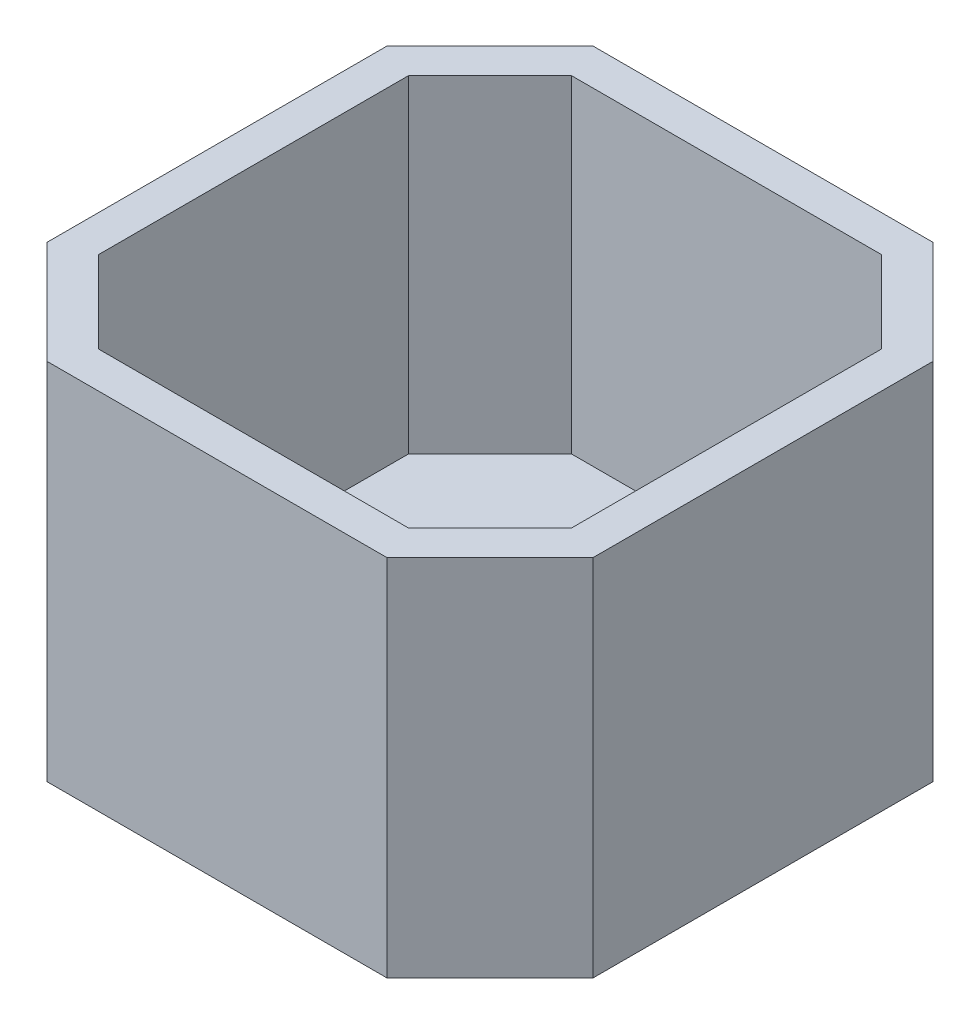
ISO-10303-21;
HEADER;
FILE_DESCRIPTION(('STEP AP214'),'2;1');
FILE_NAME('part.step','',(''),(''),'','','');
FILE_SCHEMA(('AUTOMOTIVE_DESIGN { 1 0 10303 214 1 1 1 1 }'));
ENDSEC;
DATA;
#1=APPLICATION_CONTEXT('core data for automotive mechanical design processes');
#2=APPLICATION_PROTOCOL_DEFINITION('international standard','automotive_design',2000,#1);
#3=PRODUCT_CONTEXT('',#1,'mechanical');
#4=PRODUCT('Part','Part','',(#3));
#5=PRODUCT_RELATED_PRODUCT_CATEGORY('part','',(#4));
#6=PRODUCT_DEFINITION_FORMATION('','',#4);
#7=PRODUCT_DEFINITION_CONTEXT('part definition',#1,'design');
#8=PRODUCT_DEFINITION('design','',#6,#7);
#9=PRODUCT_DEFINITION_SHAPE('','',#8);
#10=(LENGTH_UNIT() NAMED_UNIT(*) SI_UNIT(.MILLI.,.METRE.));
#11=(NAMED_UNIT(*) PLANE_ANGLE_UNIT() SI_UNIT($,.RADIAN.));
#12=(NAMED_UNIT(*) SI_UNIT($,.STERADIAN.) SOLID_ANGLE_UNIT());
#13=UNCERTAINTY_MEASURE_WITH_UNIT(LENGTH_MEASURE(1.E-05),#10,'distance_accuracy_value','');
#14=(GEOMETRIC_REPRESENTATION_CONTEXT(3) GLOBAL_UNCERTAINTY_ASSIGNED_CONTEXT((#13)) GLOBAL_UNIT_ASSIGNED_CONTEXT((#10,
#11,#12)) REPRESENTATION_CONTEXT('',''));
#15=CARTESIAN_POINT('',(0.,0.,0.));
#16=DIRECTION('',(0.,0.,1.));
#17=DIRECTION('',(1.,0.,0.));
#18=AXIS2_PLACEMENT_3D('',#15,#16,#17);
#19=CARTESIAN_POINT('',(-15.,20.,9.34314575050762));
#20=DIRECTION('',(0.707106781186548,0.,-0.707106781186547));
#21=DIRECTION('',(-0.707106781186547,0.,-0.707106781186548));
#22=AXIS2_PLACEMENT_3D('',#19,#20,#21);
#23=PLANE('',#22);
#24=DIRECTION('',(0.707106781186547,0.,0.707106781186548));
#25=VECTOR('',#24,1.);
#26=CARTESIAN_POINT('',(-15.,0.,9.34314575050762));
#27=LINE('',#26,#25);
#28=CARTESIAN_POINT('',(-15.,0.,9.34314575050762));
#29=VERTEX_POINT('',#28);
#30=CARTESIAN_POINT('',(-9.34314575050762,0.,15.));
#31=VERTEX_POINT('',#30);
#32=EDGE_CURVE('E141',#29,#31,#27,.T.);
#33=ORIENTED_EDGE('',*,*,#32,.T.);
#34=DIRECTION('',(0.,-1.,0.));
#35=VECTOR('',#34,1.);
#36=CARTESIAN_POINT('',(-9.34314575050762,20.,15.));
#37=LINE('',#36,#35);
#38=CARTESIAN_POINT('',(-9.34314575050762,20.,15.));
#39=VERTEX_POINT('',#38);
#40=EDGE_CURVE('E11',#39,#31,#37,.T.);
#41=ORIENTED_EDGE('',*,*,#40,.F.);
#42=DIRECTION('',(0.707106781186547,0.,0.707106781186548));
#43=VECTOR('',#42,1.);
#44=CARTESIAN_POINT('',(-15.,20.,9.34314575050762));
#45=LINE('',#44,#43);
#46=CARTESIAN_POINT('',(-15.,20.,9.34314575050762));
#47=VERTEX_POINT('',#46);
#48=EDGE_CURVE('E157',#47,#39,#45,.T.);
#49=ORIENTED_EDGE('',*,*,#48,.F.);
#50=DIRECTION('',(0.,-1.,0.));
#51=VECTOR('',#50,1.);
#52=CARTESIAN_POINT('',(-15.,20.,9.34314575050762));
#53=LINE('',#52,#51);
#54=EDGE_CURVE('E137',#47,#29,#53,.T.);
#55=ORIENTED_EDGE('',*,*,#54,.T.);
#56=EDGE_LOOP('',(#33,#41,#49,#55));
#57=FACE_BOUND('',#56,.T.);
#58=ADVANCED_FACE('F33',(#57),#23,.F.);
#59=CARTESIAN_POINT('',(9.34314575050762,20.,15.));
#60=DIRECTION('',(0.,0.,-1.));
#61=DIRECTION('',(-1.,0.,0.));
#62=AXIS2_PLACEMENT_3D('',#59,#60,#61);
#63=PLANE('',#62);
#64=DIRECTION('',(1.,0.,0.));
#65=VECTOR('',#64,1.);
#66=CARTESIAN_POINT('',(9.34314575050762,0.,15.));
#67=LINE('',#66,#65);
#68=CARTESIAN_POINT('',(9.34314575050762,0.,15.));
#69=VERTEX_POINT('',#68);
#70=EDGE_CURVE('E144',#31,#69,#67,.T.);
#71=ORIENTED_EDGE('',*,*,#70,.T.);
#72=DIRECTION('',(0.,-1.,0.));
#73=VECTOR('',#72,1.);
#74=CARTESIAN_POINT('',(9.34314575050762,20.,15.));
#75=LINE('',#74,#73);
#76=CARTESIAN_POINT('',(9.34314575050762,20.,15.));
#77=VERTEX_POINT('',#76);
#78=EDGE_CURVE('E40',#77,#69,#75,.T.);
#79=ORIENTED_EDGE('',*,*,#78,.F.);
#80=DIRECTION('',(1.,0.,0.));
#81=VECTOR('',#80,1.);
#82=CARTESIAN_POINT('',(9.34314575050762,20.,15.));
#83=LINE('',#82,#81);
#84=EDGE_CURVE('E97',#39,#77,#83,.T.);
#85=ORIENTED_EDGE('',*,*,#84,.F.);
#86=ORIENTED_EDGE('',*,*,#40,.T.);
#87=EDGE_LOOP('',(#71,#79,#85,#86));
#88=FACE_BOUND('',#87,.T.);
#89=ADVANCED_FACE('F331',(#88),#63,.F.);
#90=CARTESIAN_POINT('',(15.,20.,9.34314575050762));
#91=DIRECTION('',(-0.707106781186548,0.,-0.707106781186547));
#92=DIRECTION('',(-0.707106781186547,0.,0.707106781186548));
#93=AXIS2_PLACEMENT_3D('',#90,#91,#92);
#94=PLANE('',#93);
#95=DIRECTION('',(0.707106781186547,0.,-0.707106781186548));
#96=VECTOR('',#95,1.);
#97=CARTESIAN_POINT('',(15.,0.,9.34314575050762));
#98=LINE('',#97,#96);
#99=CARTESIAN_POINT('',(15.,0.,9.34314575050762));
#100=VERTEX_POINT('',#99);
#101=EDGE_CURVE('E147',#69,#100,#98,.T.);
#102=ORIENTED_EDGE('',*,*,#101,.T.);
#103=DIRECTION('',(0.,-1.,0.));
#104=VECTOR('',#103,1.);
#105=CARTESIAN_POINT('',(15.,20.,9.34314575050762));
#106=LINE('',#105,#104);
#107=CARTESIAN_POINT('',(15.,20.,9.34314575050762));
#108=VERTEX_POINT('',#107);
#109=EDGE_CURVE('E164',#108,#100,#106,.T.);
#110=ORIENTED_EDGE('',*,*,#109,.F.);
#111=DIRECTION('',(0.707106781186547,0.,-0.707106781186548));
#112=VECTOR('',#111,1.);
#113=CARTESIAN_POINT('',(15.,20.,9.34314575050762));
#114=LINE('',#113,#112);
#115=EDGE_CURVE('E172',#77,#108,#114,.T.);
#116=ORIENTED_EDGE('',*,*,#115,.F.);
#117=ORIENTED_EDGE('',*,*,#78,.T.);
#118=EDGE_LOOP('',(#102,#110,#116,#117));
#119=FACE_BOUND('',#118,.T.);
#120=ADVANCED_FACE('F170',(#119),#94,.F.);
#121=CARTESIAN_POINT('',(15.,20.,9.34314575050762));
#122=DIRECTION('',(-1.,0.,0.));
#123=DIRECTION('',(0.,0.,1.));
#124=AXIS2_PLACEMENT_3D('',#121,#122,#123);
#125=PLANE('',#124);
#126=DIRECTION('',(0.,0.,-1.));
#127=VECTOR('',#126,1.);
#128=CARTESIAN_POINT('',(15.,0.,9.34314575050762));
#129=LINE('',#128,#127);
#130=CARTESIAN_POINT('',(15.,0.,-9.34314575050762));
#131=VERTEX_POINT('',#130);
#132=EDGE_CURVE('E149',#100,#131,#129,.T.);
#133=ORIENTED_EDGE('',*,*,#132,.T.);
#134=DIRECTION('',(0.,-1.,0.));
#135=VECTOR('',#134,1.);
#136=CARTESIAN_POINT('',(15.,20.,-9.34314575050762));
#137=LINE('',#136,#135);
#138=CARTESIAN_POINT('',(15.,20.,-9.34314575050762));
#139=VERTEX_POINT('',#138);
#140=EDGE_CURVE('E161',#139,#131,#137,.T.);
#141=ORIENTED_EDGE('',*,*,#140,.F.);
#142=DIRECTION('',(0.,0.,-1.));
#143=VECTOR('',#142,1.);
#144=CARTESIAN_POINT('',(15.,20.,9.34314575050762));
#145=LINE('',#144,#143);
#146=EDGE_CURVE('E184',#108,#139,#145,.T.);
#147=ORIENTED_EDGE('',*,*,#146,.F.);
#148=ORIENTED_EDGE('',*,*,#109,.T.);
#149=EDGE_LOOP('',(#133,#141,#147,#148));
#150=FACE_BOUND('',#149,.T.);
#151=ADVANCED_FACE('F180',(#150),#125,.F.);
#152=CARTESIAN_POINT('',(9.34314575050762,20.,-15.));
#153=DIRECTION('',(-0.707106781186548,0.,0.707106781186548));
#154=DIRECTION('',(0.707106781186548,0.,0.707106781186548));
#155=AXIS2_PLACEMENT_3D('',#152,#153,#154);
#156=PLANE('',#155);
#157=DIRECTION('',(-0.707106781186547,0.,-0.707106781186547));
#158=VECTOR('',#157,1.);
#159=CARTESIAN_POINT('',(9.34314575050762,0.,-15.));
#160=LINE('',#159,#158);
#161=CARTESIAN_POINT('',(9.34314575050762,0.,-15.));
#162=VERTEX_POINT('',#161);
#163=EDGE_CURVE('E151',#131,#162,#160,.T.);
#164=ORIENTED_EDGE('',*,*,#163,.T.);
#165=DIRECTION('',(0.,-1.,0.));
#166=VECTOR('',#165,1.);
#167=CARTESIAN_POINT('',(9.34314575050762,20.,-15.));
#168=LINE('',#167,#166);
#169=CARTESIAN_POINT('',(9.34314575050762,20.,-15.));
#170=VERTEX_POINT('',#169);
#171=EDGE_CURVE('E132',#170,#162,#168,.T.);
#172=ORIENTED_EDGE('',*,*,#171,.F.);
#173=DIRECTION('',(-0.707106781186547,0.,-0.707106781186547));
#174=VECTOR('',#173,1.);
#175=CARTESIAN_POINT('',(9.34314575050762,20.,-15.));
#176=LINE('',#175,#174);
#177=EDGE_CURVE('E120',#139,#170,#176,.T.);
#178=ORIENTED_EDGE('',*,*,#177,.F.);
#179=ORIENTED_EDGE('',*,*,#140,.T.);
#180=EDGE_LOOP('',(#164,#172,#178,#179));
#181=FACE_BOUND('',#180,.T.);
#182=ADVANCED_FACE('F183',(#181),#156,.F.);
#183=CARTESIAN_POINT('',(9.34314575050762,20.,-15.));
#184=DIRECTION('',(0.,0.,1.));
#185=DIRECTION('',(1.,0.,0.));
#186=AXIS2_PLACEMENT_3D('',#183,#184,#185);
#187=PLANE('',#186);
#188=DIRECTION('',(-1.,0.,0.));
#189=VECTOR('',#188,1.);
#190=CARTESIAN_POINT('',(9.34314575050762,0.,-15.));
#191=LINE('',#190,#189);
#192=CARTESIAN_POINT('',(-9.34314575050762,0.,-15.));
#193=VERTEX_POINT('',#192);
#194=EDGE_CURVE('E129',#162,#193,#191,.T.);
#195=ORIENTED_EDGE('',*,*,#194,.T.);
#196=DIRECTION('',(0.,-1.,0.));
#197=VECTOR('',#196,1.);
#198=CARTESIAN_POINT('',(-9.34314575050762,20.,-15.));
#199=LINE('',#198,#197);
#200=CARTESIAN_POINT('',(-9.34314575050762,20.,-15.));
#201=VERTEX_POINT('',#200);
#202=EDGE_CURVE('E126',#201,#193,#199,.T.);
#203=ORIENTED_EDGE('',*,*,#202,.F.);
#204=DIRECTION('',(-1.,0.,0.));
#205=VECTOR('',#204,1.);
#206=CARTESIAN_POINT('',(9.34314575050762,20.,-15.));
#207=LINE('',#206,#205);
#208=EDGE_CURVE('E113',#170,#201,#207,.T.);
#209=ORIENTED_EDGE('',*,*,#208,.F.);
#210=ORIENTED_EDGE('',*,*,#171,.T.);
#211=EDGE_LOOP('',(#195,#203,#209,#210));
#212=FACE_BOUND('',#211,.T.);
#213=ADVANCED_FACE('F127',(#212),#187,.F.);
#214=CARTESIAN_POINT('',(-9.34314575050762,20.,-15.));
#215=DIRECTION('',(0.707106781186548,0.,0.707106781186547));
#216=DIRECTION('',(0.707106781186547,0.,-0.707106781186548));
#217=AXIS2_PLACEMENT_3D('',#214,#215,#216);
#218=PLANE('',#217);
#219=DIRECTION('',(-0.707106781186547,0.,0.707106781186548));
#220=VECTOR('',#219,1.);
#221=CARTESIAN_POINT('',(-9.34314575050762,0.,-15.));
#222=LINE('',#221,#220);
#223=CARTESIAN_POINT('',(-15.,0.,-9.34314575050762));
#224=VERTEX_POINT('',#223);
#225=EDGE_CURVE('E154',#193,#224,#222,.T.);
#226=ORIENTED_EDGE('',*,*,#225,.T.);
#227=DIRECTION('',(0.,-1.,0.));
#228=VECTOR('',#227,1.);
#229=CARTESIAN_POINT('',(-15.,20.,-9.34314575050762));
#230=LINE('',#229,#228);
#231=CARTESIAN_POINT('',(-15.,20.,-9.34314575050762));
#232=VERTEX_POINT('',#231);
#233=EDGE_CURVE('E133',#232,#224,#230,.T.);
#234=ORIENTED_EDGE('',*,*,#233,.F.);
#235=DIRECTION('',(-0.707106781186547,0.,0.707106781186548));
#236=VECTOR('',#235,1.);
#237=CARTESIAN_POINT('',(-9.34314575050762,20.,-15.));
#238=LINE('',#237,#236);
#239=EDGE_CURVE('E117',#201,#232,#238,.T.);
#240=ORIENTED_EDGE('',*,*,#239,.F.);
#241=ORIENTED_EDGE('',*,*,#202,.T.);
#242=EDGE_LOOP('',(#226,#234,#240,#241));
#243=FACE_BOUND('',#242,.T.);
#244=ADVANCED_FACE('F135',(#243),#218,.F.);
#245=CARTESIAN_POINT('',(-15.,20.,9.34314575050762));
#246=DIRECTION('',(1.,0.,0.));
#247=DIRECTION('',(0.,0.,-1.));
#248=AXIS2_PLACEMENT_3D('',#245,#246,#247);
#249=PLANE('',#248);
#250=DIRECTION('',(0.,0.,1.));
#251=VECTOR('',#250,1.);
#252=CARTESIAN_POINT('',(-15.,0.,9.34314575050762));
#253=LINE('',#252,#251);
#254=EDGE_CURVE('E89',#224,#29,#253,.T.);
#255=ORIENTED_EDGE('',*,*,#254,.T.);
#256=ORIENTED_EDGE('',*,*,#54,.F.);
#257=DIRECTION('',(0.,0.,1.));
#258=VECTOR('',#257,1.);
#259=CARTESIAN_POINT('',(-15.,20.,9.34314575050762));
#260=LINE('',#259,#258);
#261=EDGE_CURVE('E56',#232,#47,#260,.T.);
#262=ORIENTED_EDGE('',*,*,#261,.F.);
#263=ORIENTED_EDGE('',*,*,#233,.T.);
#264=EDGE_LOOP('',(#255,#256,#262,#263));
#265=FACE_BOUND('',#264,.T.);
#266=ADVANCED_FACE('F338',(#265),#249,.F.);
#267=CARTESIAN_POINT('',(0.,20.,0.));
#268=DIRECTION('',(0.,-1.,0.));
#269=DIRECTION('',(0.,0.,-1.));
#270=AXIS2_PLACEMENT_3D('',#267,#268,#269);
#271=PLANE('',#270);
#272=DIRECTION('',(-0.707106781186547,0.,0.707106781186547));
#273=VECTOR('',#272,1.);
#274=CARTESIAN_POINT('',(-8.51471862576143,20.,-13.));
#275=LINE('',#274,#273);
#276=CARTESIAN_POINT('',(-8.51471862576143,20.,-13.));
#277=VERTEX_POINT('',#276);
#278=CARTESIAN_POINT('',(-13.,20.,-8.51471862576143));
#279=VERTEX_POINT('',#278);
#280=EDGE_CURVE('E231',#277,#279,#275,.T.);
#281=ORIENTED_EDGE('',*,*,#280,.F.);
#282=DIRECTION('',(-1.,0.,0.));
#283=VECTOR('',#282,1.);
#284=CARTESIAN_POINT('',(-8.51471862576143,20.,-13.));
#285=LINE('',#284,#283);
#286=CARTESIAN_POINT('',(8.51471862576143,20.,-13.));
#287=VERTEX_POINT('',#286);
#288=EDGE_CURVE('E47',#287,#277,#285,.T.);
#289=ORIENTED_EDGE('',*,*,#288,.F.);
#290=DIRECTION('',(-0.707106781186547,0.,-0.707106781186548));
#291=VECTOR('',#290,1.);
#292=CARTESIAN_POINT('',(13.,20.,-8.51471862576143));
#293=LINE('',#292,#291);
#294=CARTESIAN_POINT('',(13.,20.,-8.51471862576143));
#295=VERTEX_POINT('',#294);
#296=EDGE_CURVE('E212',#295,#287,#293,.T.);
#297=ORIENTED_EDGE('',*,*,#296,.F.);
#298=DIRECTION('',(0.,0.,-1.));
#299=VECTOR('',#298,1.);
#300=CARTESIAN_POINT('',(13.,20.,8.51471862576143));
#301=LINE('',#300,#299);
#302=CARTESIAN_POINT('',(13.,20.,8.51471862576143));
#303=VERTEX_POINT('',#302);
#304=EDGE_CURVE('E216',#303,#295,#301,.T.);
#305=ORIENTED_EDGE('',*,*,#304,.F.);
#306=DIRECTION('',(0.707106781186548,0.,-0.707106781186548));
#307=VECTOR('',#306,1.);
#308=CARTESIAN_POINT('',(8.51471862576143,20.,13.));
#309=LINE('',#308,#307);
#310=CARTESIAN_POINT('',(8.51471862576143,20.,13.));
#311=VERTEX_POINT('',#310);
#312=EDGE_CURVE('E219',#311,#303,#309,.T.);
#313=ORIENTED_EDGE('',*,*,#312,.F.);
#314=DIRECTION('',(1.,0.,0.));
#315=VECTOR('',#314,1.);
#316=CARTESIAN_POINT('',(-8.51471862576143,20.,13.));
#317=LINE('',#316,#315);
#318=CARTESIAN_POINT('',(-8.51471862576143,20.,13.));
#319=VERTEX_POINT('',#318);
#320=EDGE_CURVE('E222',#319,#311,#317,.T.);
#321=ORIENTED_EDGE('',*,*,#320,.F.);
#322=DIRECTION('',(0.707106781186548,0.,0.707106781186548));
#323=VECTOR('',#322,1.);
#324=CARTESIAN_POINT('',(-13.,20.,8.51471862576143));
#325=LINE('',#324,#323);
#326=CARTESIAN_POINT('',(-13.,20.,8.51471862576143));
#327=VERTEX_POINT('',#326);
#328=EDGE_CURVE('E225',#327,#319,#325,.T.);
#329=ORIENTED_EDGE('',*,*,#328,.F.);
#330=DIRECTION('',(0.,0.,1.));
#331=VECTOR('',#330,1.);
#332=CARTESIAN_POINT('',(-13.,20.,-8.51471862576143));
#333=LINE('',#332,#331);
#334=EDGE_CURVE('E228',#279,#327,#333,.T.);
#335=ORIENTED_EDGE('',*,*,#334,.F.);
#336=EDGE_LOOP('',(#281,#289,#297,#305,#313,#321,#329,#335));
#337=FACE_BOUND('',#336,.T.);
#338=ORIENTED_EDGE('',*,*,#48,.T.);
#339=ORIENTED_EDGE('',*,*,#84,.T.);
#340=ORIENTED_EDGE('',*,*,#115,.T.);
#341=ORIENTED_EDGE('',*,*,#146,.T.);
#342=ORIENTED_EDGE('',*,*,#177,.T.);
#343=ORIENTED_EDGE('',*,*,#208,.T.);
#344=ORIENTED_EDGE('',*,*,#239,.T.);
#345=ORIENTED_EDGE('',*,*,#261,.T.);
#346=EDGE_LOOP('',(#338,#339,#340,#341,#342,#343,#344,#345));
#347=FACE_BOUND('',#346,.T.);
#348=ADVANCED_FACE('F115',(#337,#347),#271,.F.);
#349=CARTESIAN_POINT('',(0.,0.,0.));
#350=DIRECTION('',(0.,-1.,0.));
#351=DIRECTION('',(0.,0.,-1.));
#352=AXIS2_PLACEMENT_3D('',#349,#350,#351);
#353=PLANE('',#352);
#354=ORIENTED_EDGE('',*,*,#32,.F.);
#355=ORIENTED_EDGE('',*,*,#254,.F.);
#356=ORIENTED_EDGE('',*,*,#225,.F.);
#357=ORIENTED_EDGE('',*,*,#194,.F.);
#358=ORIENTED_EDGE('',*,*,#163,.F.);
#359=ORIENTED_EDGE('',*,*,#132,.F.);
#360=ORIENTED_EDGE('',*,*,#101,.F.);
#361=ORIENTED_EDGE('',*,*,#70,.F.);
#362=EDGE_LOOP('',(#354,#355,#356,#357,#358,#359,#360,#361));
#363=FACE_BOUND('',#362,.T.);
#364=ADVANCED_FACE('F176',(#363),#353,.T.);
#365=CARTESIAN_POINT('',(-8.51471862576143,2.,-13.));
#366=DIRECTION('',(0.,0.,-1.));
#367=DIRECTION('',(-1.,0.,0.));
#368=AXIS2_PLACEMENT_3D('',#365,#366,#367);
#369=PLANE('',#368);
#370=ORIENTED_EDGE('',*,*,#288,.T.);
#371=DIRECTION('',(0.,1.,0.));
#372=VECTOR('',#371,1.);
#373=CARTESIAN_POINT('',(-8.51471862576143,2.,-13.));
#374=LINE('',#373,#372);
#375=CARTESIAN_POINT('',(-8.51471862576143,2.,-13.));
#376=VERTEX_POINT('',#375);
#377=EDGE_CURVE('E190',#376,#277,#374,.T.);
#378=ORIENTED_EDGE('',*,*,#377,.F.);
#379=DIRECTION('',(-1.,0.,0.));
#380=VECTOR('',#379,1.);
#381=CARTESIAN_POINT('',(-8.51471862576143,2.,-13.));
#382=LINE('',#381,#380);
#383=CARTESIAN_POINT('',(8.51471862576143,2.,-13.));
#384=VERTEX_POINT('',#383);
#385=EDGE_CURVE('E215',#384,#376,#382,.T.);
#386=ORIENTED_EDGE('',*,*,#385,.F.);
#387=DIRECTION('',(0.,1.,0.));
#388=VECTOR('',#387,1.);
#389=CARTESIAN_POINT('',(8.51471862576143,2.,-13.));
#390=LINE('',#389,#388);
#391=EDGE_CURVE('E145',#384,#287,#390,.T.);
#392=ORIENTED_EDGE('',*,*,#391,.T.);
#393=EDGE_LOOP('',(#370,#378,#386,#392));
#394=FACE_BOUND('',#393,.T.);
#395=ADVANCED_FACE('F264',(#394),#369,.F.);
#396=CARTESIAN_POINT('',(13.,2.,-8.51471862576143));
#397=DIRECTION('',(0.707106781186548,0.,-0.707106781186547));
#398=DIRECTION('',(-0.707106781186547,0.,-0.707106781186548));
#399=AXIS2_PLACEMENT_3D('',#396,#397,#398);
#400=PLANE('',#399);
#401=ORIENTED_EDGE('',*,*,#296,.T.);
#402=ORIENTED_EDGE('',*,*,#391,.F.);
#403=DIRECTION('',(-0.707106781186547,0.,-0.707106781186548));
#404=VECTOR('',#403,1.);
#405=CARTESIAN_POINT('',(13.,2.,-8.51471862576143));
#406=LINE('',#405,#404);
#407=CARTESIAN_POINT('',(13.,2.,-8.51471862576143));
#408=VERTEX_POINT('',#407);
#409=EDGE_CURVE('E193',#408,#384,#406,.T.);
#410=ORIENTED_EDGE('',*,*,#409,.F.);
#411=DIRECTION('',(0.,1.,0.));
#412=VECTOR('',#411,1.);
#413=CARTESIAN_POINT('',(13.,2.,-8.51471862576143));
#414=LINE('',#413,#412);
#415=EDGE_CURVE('E208',#408,#295,#414,.T.);
#416=ORIENTED_EDGE('',*,*,#415,.T.);
#417=EDGE_LOOP('',(#401,#402,#410,#416));
#418=FACE_BOUND('',#417,.T.);
#419=ADVANCED_FACE('F284',(#418),#400,.F.);
#420=CARTESIAN_POINT('',(13.,2.,8.51471862576143));
#421=DIRECTION('',(1.,0.,0.));
#422=DIRECTION('',(0.,0.,-1.));
#423=AXIS2_PLACEMENT_3D('',#420,#421,#422);
#424=PLANE('',#423);
#425=ORIENTED_EDGE('',*,*,#304,.T.);
#426=ORIENTED_EDGE('',*,*,#415,.F.);
#427=DIRECTION('',(0.,0.,-1.));
#428=VECTOR('',#427,1.);
#429=CARTESIAN_POINT('',(13.,2.,8.51471862576143));
#430=LINE('',#429,#428);
#431=CARTESIAN_POINT('',(13.,2.,8.51471862576143));
#432=VERTEX_POINT('',#431);
#433=EDGE_CURVE('E237',#432,#408,#430,.T.);
#434=ORIENTED_EDGE('',*,*,#433,.F.);
#435=DIRECTION('',(0.,1.,0.));
#436=VECTOR('',#435,1.);
#437=CARTESIAN_POINT('',(13.,2.,8.51471862576143));
#438=LINE('',#437,#436);
#439=EDGE_CURVE('E205',#432,#303,#438,.T.);
#440=ORIENTED_EDGE('',*,*,#439,.T.);
#441=EDGE_LOOP('',(#425,#426,#434,#440));
#442=FACE_BOUND('',#441,.T.);
#443=ADVANCED_FACE('F289',(#442),#424,.F.);
#444=CARTESIAN_POINT('',(8.51471862576143,2.,13.));
#445=DIRECTION('',(0.707106781186547,0.,0.707106781186547));
#446=DIRECTION('',(0.707106781186548,0.,-0.707106781186548));
#447=AXIS2_PLACEMENT_3D('',#444,#445,#446);
#448=PLANE('',#447);
#449=ORIENTED_EDGE('',*,*,#312,.T.);
#450=ORIENTED_EDGE('',*,*,#439,.F.);
#451=DIRECTION('',(0.707106781186548,0.,-0.707106781186548));
#452=VECTOR('',#451,1.);
#453=CARTESIAN_POINT('',(8.51471862576143,2.,13.));
#454=LINE('',#453,#452);
#455=CARTESIAN_POINT('',(8.51471862576143,2.,13.));
#456=VERTEX_POINT('',#455);
#457=EDGE_CURVE('E240',#456,#432,#454,.T.);
#458=ORIENTED_EDGE('',*,*,#457,.F.);
#459=DIRECTION('',(0.,1.,0.));
#460=VECTOR('',#459,1.);
#461=CARTESIAN_POINT('',(8.51471862576143,2.,13.));
#462=LINE('',#461,#460);
#463=EDGE_CURVE('E202',#456,#311,#462,.T.);
#464=ORIENTED_EDGE('',*,*,#463,.T.);
#465=EDGE_LOOP('',(#449,#450,#458,#464));
#466=FACE_BOUND('',#465,.T.);
#467=ADVANCED_FACE('F315',(#466),#448,.F.);
#468=CARTESIAN_POINT('',(-8.51471862576143,2.,13.));
#469=DIRECTION('',(0.,0.,1.));
#470=DIRECTION('',(1.,0.,0.));
#471=AXIS2_PLACEMENT_3D('',#468,#469,#470);
#472=PLANE('',#471);
#473=ORIENTED_EDGE('',*,*,#320,.T.);
#474=ORIENTED_EDGE('',*,*,#463,.F.);
#475=DIRECTION('',(1.,0.,0.));
#476=VECTOR('',#475,1.);
#477=CARTESIAN_POINT('',(-8.51471862576143,2.,13.));
#478=LINE('',#477,#476);
#479=CARTESIAN_POINT('',(-8.51471862576143,2.,13.));
#480=VERTEX_POINT('',#479);
#481=EDGE_CURVE('E243',#480,#456,#478,.T.);
#482=ORIENTED_EDGE('',*,*,#481,.F.);
#483=DIRECTION('',(0.,1.,0.));
#484=VECTOR('',#483,1.);
#485=CARTESIAN_POINT('',(-8.51471862576143,2.,13.));
#486=LINE('',#485,#484);
#487=EDGE_CURVE('E199',#480,#319,#486,.T.);
#488=ORIENTED_EDGE('',*,*,#487,.T.);
#489=EDGE_LOOP('',(#473,#474,#482,#488));
#490=FACE_BOUND('',#489,.T.);
#491=ADVANCED_FACE('F318',(#490),#472,.F.);
#492=CARTESIAN_POINT('',(-13.,2.,8.51471862576143));
#493=DIRECTION('',(-0.707106781186547,0.,0.707106781186547));
#494=DIRECTION('',(0.707106781186548,0.,0.707106781186548));
#495=AXIS2_PLACEMENT_3D('',#492,#493,#494);
#496=PLANE('',#495);
#497=ORIENTED_EDGE('',*,*,#328,.T.);
#498=ORIENTED_EDGE('',*,*,#487,.F.);
#499=DIRECTION('',(0.707106781186548,0.,0.707106781186548));
#500=VECTOR('',#499,1.);
#501=CARTESIAN_POINT('',(-13.,2.,8.51471862576143));
#502=LINE('',#501,#500);
#503=CARTESIAN_POINT('',(-13.,2.,8.51471862576143));
#504=VERTEX_POINT('',#503);
#505=EDGE_CURVE('E246',#504,#480,#502,.T.);
#506=ORIENTED_EDGE('',*,*,#505,.F.);
#507=DIRECTION('',(0.,1.,0.));
#508=VECTOR('',#507,1.);
#509=CARTESIAN_POINT('',(-13.,2.,8.51471862576143));
#510=LINE('',#509,#508);
#511=EDGE_CURVE('E196',#504,#327,#510,.T.);
#512=ORIENTED_EDGE('',*,*,#511,.T.);
#513=EDGE_LOOP('',(#497,#498,#506,#512));
#514=FACE_BOUND('',#513,.T.);
#515=ADVANCED_FACE('F321',(#514),#496,.F.);
#516=CARTESIAN_POINT('',(-13.,2.,-8.51471862576143));
#517=DIRECTION('',(-1.,0.,0.));
#518=DIRECTION('',(0.,0.,1.));
#519=AXIS2_PLACEMENT_3D('',#516,#517,#518);
#520=PLANE('',#519);
#521=ORIENTED_EDGE('',*,*,#334,.T.);
#522=ORIENTED_EDGE('',*,*,#511,.F.);
#523=DIRECTION('',(0.,0.,1.));
#524=VECTOR('',#523,1.);
#525=CARTESIAN_POINT('',(-13.,2.,-8.51471862576143));
#526=LINE('',#525,#524);
#527=CARTESIAN_POINT('',(-13.,2.,-8.51471862576143));
#528=VERTEX_POINT('',#527);
#529=EDGE_CURVE('E249',#528,#504,#526,.T.);
#530=ORIENTED_EDGE('',*,*,#529,.F.);
#531=DIRECTION('',(0.,1.,0.));
#532=VECTOR('',#531,1.);
#533=CARTESIAN_POINT('',(-13.,2.,-8.51471862576143));
#534=LINE('',#533,#532);
#535=EDGE_CURVE('E192',#528,#279,#534,.T.);
#536=ORIENTED_EDGE('',*,*,#535,.T.);
#537=EDGE_LOOP('',(#521,#522,#530,#536));
#538=FACE_BOUND('',#537,.T.);
#539=ADVANCED_FACE('F304',(#538),#520,.F.);
#540=CARTESIAN_POINT('',(-8.51471862576143,2.,-13.));
#541=DIRECTION('',(-0.707106781186547,0.,-0.707106781186547));
#542=DIRECTION('',(-0.707106781186548,0.,0.707106781186548));
#543=AXIS2_PLACEMENT_3D('',#540,#541,#542);
#544=PLANE('',#543);
#545=ORIENTED_EDGE('',*,*,#280,.T.);
#546=ORIENTED_EDGE('',*,*,#535,.F.);
#547=DIRECTION('',(-0.707106781186547,0.,0.707106781186547));
#548=VECTOR('',#547,1.);
#549=CARTESIAN_POINT('',(-8.51471862576143,2.,-13.));
#550=LINE('',#549,#548);
#551=EDGE_CURVE('E252',#376,#528,#550,.T.);
#552=ORIENTED_EDGE('',*,*,#551,.F.);
#553=ORIENTED_EDGE('',*,*,#377,.T.);
#554=EDGE_LOOP('',(#545,#546,#552,#553));
#555=FACE_BOUND('',#554,.T.);
#556=ADVANCED_FACE('F298',(#555),#544,.F.);
#557=CARTESIAN_POINT('',(0.,2.,0.));
#558=DIRECTION('',(0.,1.,0.));
#559=DIRECTION('',(0.,0.,1.));
#560=AXIS2_PLACEMENT_3D('',#557,#558,#559);
#561=PLANE('',#560);
#562=ORIENTED_EDGE('',*,*,#385,.T.);
#563=ORIENTED_EDGE('',*,*,#551,.T.);
#564=ORIENTED_EDGE('',*,*,#529,.T.);
#565=ORIENTED_EDGE('',*,*,#505,.T.);
#566=ORIENTED_EDGE('',*,*,#481,.T.);
#567=ORIENTED_EDGE('',*,*,#457,.T.);
#568=ORIENTED_EDGE('',*,*,#433,.T.);
#569=ORIENTED_EDGE('',*,*,#409,.T.);
#570=EDGE_LOOP('',(#562,#563,#564,#565,#566,#567,#568,#569));
#571=FACE_BOUND('',#570,.T.);
#572=ADVANCED_FACE('F259',(#571),#561,.T.);
#573=CLOSED_SHELL('',(#58,#89,#120,#151,#182,#213,#244,#266,#348,#364,#395,#419,#443,#467,#491,
#515,#539,#556,#572));
#574=MANIFOLD_SOLID_BREP('B2',#573);
#575=ADVANCED_BREP_SHAPE_REPRESENTATION('',(#18,#574),#14);
#576=SHAPE_DEFINITION_REPRESENTATION(#9,#575);
ENDSEC;
END-ISO-10303-21;
